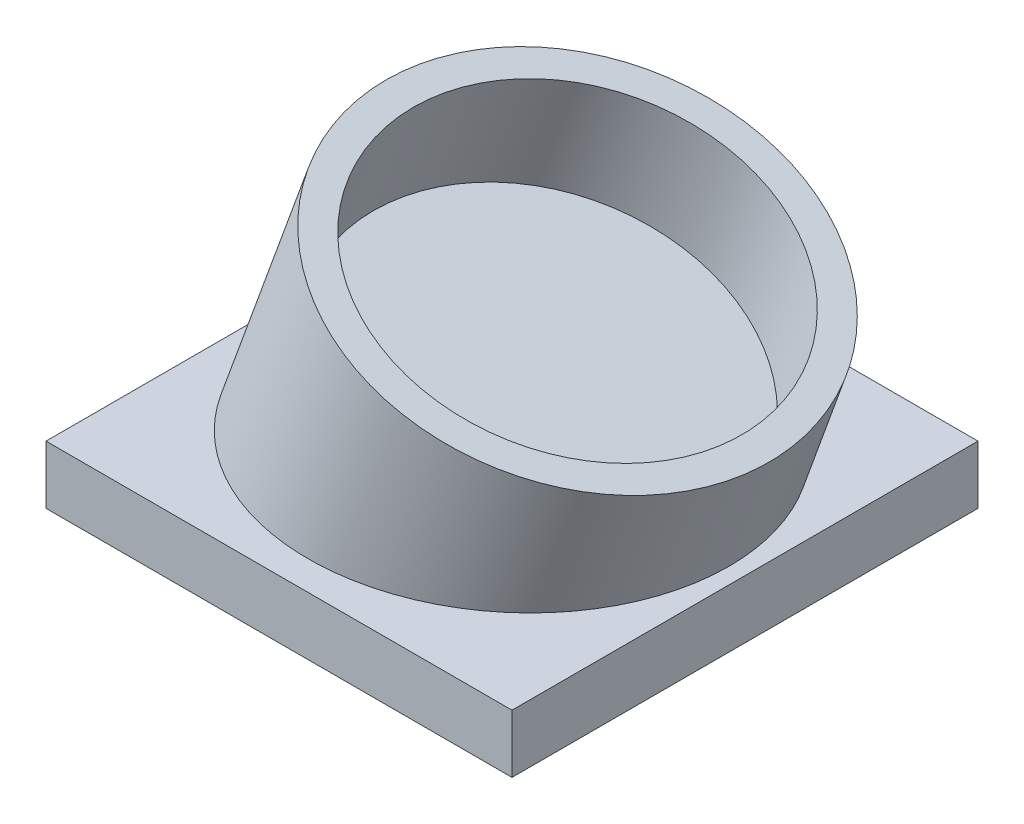
ISO-10303-21;
HEADER;
FILE_DESCRIPTION(('STEP AP214'),'2;1');
FILE_NAME('part.step','',(''),(''),'','','');
FILE_SCHEMA(('AUTOMOTIVE_DESIGN { 1 0 10303 214 1 1 1 1 }'));
ENDSEC;
DATA;
#1=APPLICATION_CONTEXT('core data for automotive mechanical design processes');
#2=APPLICATION_PROTOCOL_DEFINITION('international standard','automotive_design',2000,#1);
#3=PRODUCT_CONTEXT('',#1,'mechanical');
#4=PRODUCT('Part','Part','',(#3));
#5=PRODUCT_RELATED_PRODUCT_CATEGORY('part','',(#4));
#6=PRODUCT_DEFINITION_FORMATION('','',#4);
#7=PRODUCT_DEFINITION_CONTEXT('part definition',#1,'design');
#8=PRODUCT_DEFINITION('design','',#6,#7);
#9=PRODUCT_DEFINITION_SHAPE('','',#8);
#10=(LENGTH_UNIT() NAMED_UNIT(*) SI_UNIT(.MILLI.,.METRE.));
#11=(NAMED_UNIT(*) PLANE_ANGLE_UNIT() SI_UNIT($,.RADIAN.));
#12=(NAMED_UNIT(*) SI_UNIT($,.STERADIAN.) SOLID_ANGLE_UNIT());
#13=UNCERTAINTY_MEASURE_WITH_UNIT(LENGTH_MEASURE(1.E-05),#10,'distance_accuracy_value','');
#14=(GEOMETRIC_REPRESENTATION_CONTEXT(3) GLOBAL_UNCERTAINTY_ASSIGNED_CONTEXT((#13)) GLOBAL_UNIT_ASSIGNED_CONTEXT((#10,
#11,#12)) REPRESENTATION_CONTEXT('',''));
#15=CARTESIAN_POINT('',(0.,0.,0.));
#16=DIRECTION('',(0.,0.,1.));
#17=DIRECTION('',(1.,0.,0.));
#18=AXIS2_PLACEMENT_3D('',#15,#16,#17);
#19=CARTESIAN_POINT('',(0.,12.7,0.));
#20=DIRECTION('',(1.,0.,0.));
#21=DIRECTION('',(0.,0.,-1.));
#22=AXIS2_PLACEMENT_3D('',#19,#20,#21);
#23=PLANE('',#22);
#24=DIRECTION('',(0.,0.,1.));
#25=VECTOR('',#24,1.);
#26=CARTESIAN_POINT('',(0.,0.,0.));
#27=LINE('',#26,#25);
#28=CARTESIAN_POINT('',(0.,0.,-101.6));
#29=VERTEX_POINT('',#28);
#30=CARTESIAN_POINT('',(0.,0.,0.));
#31=VERTEX_POINT('',#30);
#32=EDGE_CURVE('E105',#29,#31,#27,.T.);
#33=ORIENTED_EDGE('',*,*,#32,.T.);
#34=DIRECTION('',(0.,-1.,0.));
#35=VECTOR('',#34,1.);
#36=CARTESIAN_POINT('',(0.,12.7,0.));
#37=LINE('',#36,#35);
#38=CARTESIAN_POINT('',(0.,12.7,0.));
#39=VERTEX_POINT('',#38);
#40=EDGE_CURVE('E47',#39,#31,#37,.T.);
#41=ORIENTED_EDGE('',*,*,#40,.F.);
#42=DIRECTION('',(0.,0.,1.));
#43=VECTOR('',#42,1.);
#44=CARTESIAN_POINT('',(0.,12.7,0.));
#45=LINE('',#44,#43);
#46=CARTESIAN_POINT('',(0.,12.7,-101.6));
#47=VERTEX_POINT('',#46);
#48=EDGE_CURVE('E91',#47,#39,#45,.T.);
#49=ORIENTED_EDGE('',*,*,#48,.F.);
#50=DIRECTION('',(0.,-1.,0.));
#51=VECTOR('',#50,1.);
#52=CARTESIAN_POINT('',(0.,12.7,-101.6));
#53=LINE('',#52,#51);
#54=EDGE_CURVE('E101',#47,#29,#53,.T.);
#55=ORIENTED_EDGE('',*,*,#54,.T.);
#56=EDGE_LOOP('',(#33,#41,#49,#55));
#57=FACE_BOUND('',#56,.T.);
#58=ADVANCED_FACE('F39',(#57),#23,.F.);
#59=CARTESIAN_POINT('',(0.,12.7,0.));
#60=DIRECTION('',(0.,0.,-1.));
#61=DIRECTION('',(-1.,0.,0.));
#62=AXIS2_PLACEMENT_3D('',#59,#60,#61);
#63=PLANE('',#62);
#64=DIRECTION('',(1.,0.,0.));
#65=VECTOR('',#64,1.);
#66=CARTESIAN_POINT('',(0.,0.,0.));
#67=LINE('',#66,#65);
#68=CARTESIAN_POINT('',(101.6,0.,0.));
#69=VERTEX_POINT('',#68);
#70=EDGE_CURVE('E96',#31,#69,#67,.T.);
#71=ORIENTED_EDGE('',*,*,#70,.T.);
#72=DIRECTION('',(0.,-1.,0.));
#73=VECTOR('',#72,1.);
#74=CARTESIAN_POINT('',(101.6,12.7,0.));
#75=LINE('',#74,#73);
#76=CARTESIAN_POINT('',(101.6,12.7,0.));
#77=VERTEX_POINT('',#76);
#78=EDGE_CURVE('E94',#77,#69,#75,.T.);
#79=ORIENTED_EDGE('',*,*,#78,.F.);
#80=DIRECTION('',(1.,0.,0.));
#81=VECTOR('',#80,1.);
#82=CARTESIAN_POINT('',(0.,12.7,0.));
#83=LINE('',#82,#81);
#84=EDGE_CURVE('E86',#39,#77,#83,.T.);
#85=ORIENTED_EDGE('',*,*,#84,.F.);
#86=ORIENTED_EDGE('',*,*,#40,.T.);
#87=EDGE_LOOP('',(#71,#79,#85,#86));
#88=FACE_BOUND('',#87,.T.);
#89=ADVANCED_FACE('F95',(#88),#63,.F.);
#90=CARTESIAN_POINT('',(101.6,12.7,0.));
#91=DIRECTION('',(-1.,0.,0.));
#92=DIRECTION('',(0.,0.,1.));
#93=AXIS2_PLACEMENT_3D('',#90,#91,#92);
#94=PLANE('',#93);
#95=DIRECTION('',(0.,0.,-1.));
#96=VECTOR('',#95,1.);
#97=CARTESIAN_POINT('',(101.6,0.,0.));
#98=LINE('',#97,#96);
#99=CARTESIAN_POINT('',(101.6,0.,-101.6));
#100=VERTEX_POINT('',#99);
#101=EDGE_CURVE('E72',#69,#100,#98,.T.);
#102=ORIENTED_EDGE('',*,*,#101,.T.);
#103=DIRECTION('',(0.,-1.,0.));
#104=VECTOR('',#103,1.);
#105=CARTESIAN_POINT('',(101.6,12.7,-101.6));
#106=LINE('',#105,#104);
#107=CARTESIAN_POINT('',(101.6,12.7,-101.6));
#108=VERTEX_POINT('',#107);
#109=EDGE_CURVE('E97',#108,#100,#106,.T.);
#110=ORIENTED_EDGE('',*,*,#109,.F.);
#111=DIRECTION('',(0.,0.,-1.));
#112=VECTOR('',#111,1.);
#113=CARTESIAN_POINT('',(101.6,12.7,0.));
#114=LINE('',#113,#112);
#115=EDGE_CURVE('E89',#77,#108,#114,.T.);
#116=ORIENTED_EDGE('',*,*,#115,.F.);
#117=ORIENTED_EDGE('',*,*,#78,.T.);
#118=EDGE_LOOP('',(#102,#110,#116,#117));
#119=FACE_BOUND('',#118,.T.);
#120=ADVANCED_FACE('F99',(#119),#94,.F.);
#121=CARTESIAN_POINT('',(0.,12.7,-101.6));
#122=DIRECTION('',(0.,0.,1.));
#123=DIRECTION('',(1.,0.,0.));
#124=AXIS2_PLACEMENT_3D('',#121,#122,#123);
#125=PLANE('',#124);
#126=DIRECTION('',(-1.,0.,0.));
#127=VECTOR('',#126,1.);
#128=CARTESIAN_POINT('',(0.,0.,-101.6));
#129=LINE('',#128,#127);
#130=EDGE_CURVE('E78',#100,#29,#129,.T.);
#131=ORIENTED_EDGE('',*,*,#130,.T.);
#132=ORIENTED_EDGE('',*,*,#54,.F.);
#133=DIRECTION('',(-1.,0.,0.));
#134=VECTOR('',#133,1.);
#135=CARTESIAN_POINT('',(0.,12.7,-101.6));
#136=LINE('',#135,#134);
#137=EDGE_CURVE('E55',#108,#47,#136,.T.);
#138=ORIENTED_EDGE('',*,*,#137,.F.);
#139=ORIENTED_EDGE('',*,*,#109,.T.);
#140=EDGE_LOOP('',(#131,#132,#138,#139));
#141=FACE_BOUND('',#140,.T.);
#142=ADVANCED_FACE('F127',(#141),#125,.F.);
#143=CARTESIAN_POINT('',(0.,12.7,0.));
#144=DIRECTION('',(0.,-1.,0.));
#145=DIRECTION('',(0.,0.,-1.));
#146=AXIS2_PLACEMENT_3D('',#143,#144,#145);
#147=PLANE('',#146);
#148=CARTESIAN_POINT('',(50.8,12.7,-50.8));
#149=DIRECTION('',(0.,-1.,0.));
#150=DIRECTION('',(1.,0.,0.));
#151=AXIS2_PLACEMENT_3D('',#148,#149,#150);
#152=ELLIPSE('',#151,47.3027019865543,44.45);
#153=CARTESIAN_POINT('',(98.1027019865543,12.7,-50.8));
#154=VERTEX_POINT('',#153);
#155=EDGE_CURVE('E108',#154,#154,#152,.T.);
#156=ORIENTED_EDGE('',*,*,#155,.T.);
#157=EDGE_LOOP('',(#156));
#158=FACE_BOUND('',#157,.T.);
#159=ORIENTED_EDGE('',*,*,#48,.T.);
#160=ORIENTED_EDGE('',*,*,#84,.T.);
#161=ORIENTED_EDGE('',*,*,#115,.T.);
#162=ORIENTED_EDGE('',*,*,#137,.T.);
#163=EDGE_LOOP('',(#159,#160,#161,#162));
#164=FACE_BOUND('',#163,.T.);
#165=ADVANCED_FACE('F87',(#158,#164),#147,.F.);
#166=CARTESIAN_POINT('',(0.,0.,0.));
#167=DIRECTION('',(0.,-1.,0.));
#168=DIRECTION('',(0.,0.,-1.));
#169=AXIS2_PLACEMENT_3D('',#166,#167,#168);
#170=PLANE('',#169);
#171=ORIENTED_EDGE('',*,*,#32,.F.);
#172=ORIENTED_EDGE('',*,*,#130,.F.);
#173=ORIENTED_EDGE('',*,*,#101,.F.);
#174=ORIENTED_EDGE('',*,*,#70,.F.);
#175=EDGE_LOOP('',(#171,#172,#173,#174));
#176=FACE_BOUND('',#175,.T.);
#177=ADVANCED_FACE('F116',(#176),#170,.T.);
#178=CARTESIAN_POINT('',(6.42017913150263,-109.232555715637,-50.8));
#179=DIRECTION('',(0.342020143325669,0.939692620785908,0.));
#180=DIRECTION('',(-0.939692620785908,0.342020143325669,0.));
#181=AXIS2_PLACEMENT_3D('',#178,#179,#180);
#182=CYLINDRICAL_SURFACE('',#181,44.45);
#183=ORIENTED_EDGE('',*,*,#155,.F.);
#184=EDGE_LOOP('',(#183));
#185=FACE_BOUND('',#184,.T.);
#186=CARTESIAN_POINT('',(65.0877626419243,51.9553052332143,-50.8));
#187=DIRECTION('',(0.342020143325669,0.939692620785908,0.));
#188=DIRECTION('',(-0.939692620785908,0.342020143325669,0.));
#189=AXIS2_PLACEMENT_3D('',#186,#187,#188);
#190=CIRCLE('',#189,44.45);
#191=CARTESIAN_POINT('',(23.3184256479907,67.1581006040403,-50.8));
#192=VERTEX_POINT('',#191);
#193=EDGE_CURVE('E240',#192,#192,#190,.T.);
#194=ORIENTED_EDGE('',*,*,#193,.F.);
#195=EDGE_LOOP('',(#194));
#196=FACE_BOUND('',#195,.T.);
#197=ADVANCED_FACE('F118',(#185,#196),#182,.T.);
#198=CARTESIAN_POINT('',(65.0877626419243,51.9553052332143,-50.8));
#199=DIRECTION('',(0.342020143325669,0.939692620785908,0.));
#200=DIRECTION('',(-0.939692620785908,0.342020143325669,0.));
#201=AXIS2_PLACEMENT_3D('',#198,#199,#200);
#202=PLANE('',#201);
#203=ORIENTED_EDGE('',*,*,#193,.T.);
#204=EDGE_LOOP('',(#203));
#205=FACE_BOUND('',#204,.T.);
#206=CARTESIAN_POINT('',(65.0877626419243,51.9553052332143,-50.8));
#207=DIRECTION('',(0.342020143325669,0.939692620785908,0.));
#208=DIRECTION('',(-0.939692620785908,0.342020143325669,0.));
#209=AXIS2_PLACEMENT_3D('',#206,#207,#208);
#210=CIRCLE('',#209,38.1);
#211=CARTESIAN_POINT('',(29.2854737899812,64.9862726939223,-50.8));
#212=VERTEX_POINT('',#211);
#213=EDGE_CURVE('E238',#212,#212,#210,.T.);
#214=ORIENTED_EDGE('',*,*,#213,.F.);
#215=EDGE_LOOP('',(#214));
#216=FACE_BOUND('',#215,.T.);
#217=ADVANCED_FACE('F124',(#205,#216),#202,.T.);
#218=CARTESIAN_POINT('',(56.4004510014523,28.0871126652522,-50.8));
#219=DIRECTION('',(-0.342020143325669,-0.939692620785908,0.));
#220=DIRECTION('',(0.939692620785908,-0.342020143325669,0.));
#221=AXIS2_PLACEMENT_3D('',#218,#219,#220);
#222=PLANE('',#221);
#223=CARTESIAN_POINT('',(56.4004510014523,28.0871126652522,-50.8));
#224=DIRECTION('',(-0.342020143325669,-0.939692620785908,0.));
#225=DIRECTION('',(0.939692620785908,-0.342020143325669,0.));
#226=AXIS2_PLACEMENT_3D('',#223,#224,#225);
#227=CIRCLE('',#226,38.1);
#228=CARTESIAN_POINT('',(92.2027398533954,15.0561452045442,-50.8));
#229=VERTEX_POINT('',#228);
#230=EDGE_CURVE('E11',#229,#229,#227,.T.);
#231=ORIENTED_EDGE('',*,*,#230,.F.);
#232=EDGE_LOOP('',(#231));
#233=FACE_BOUND('',#232,.T.);
#234=ADVANCED_FACE('F156',(#233),#222,.F.);
#235=CARTESIAN_POINT('',(56.4004510014523,28.0871126652522,-50.8));
#236=DIRECTION('',(0.342020143325669,0.939692620785908,0.));
#237=DIRECTION('',(-0.939692620785908,0.342020143325669,0.));
#238=AXIS2_PLACEMENT_3D('',#235,#236,#237);
#239=CYLINDRICAL_SURFACE('',#238,38.1);
#240=ORIENTED_EDGE('',*,*,#230,.T.);
#241=EDGE_LOOP('',(#240));
#242=FACE_BOUND('',#241,.T.);
#243=ORIENTED_EDGE('',*,*,#213,.T.);
#244=EDGE_LOOP('',(#243));
#245=FACE_BOUND('',#244,.T.);
#246=ADVANCED_FACE('F161',(#242,#245),#239,.F.);
#247=CLOSED_SHELL('',(#58,#89,#120,#142,#165,#177,#197,#217,#234,#246));
#248=MANIFOLD_SOLID_BREP('B2',#247);
#249=ADVANCED_BREP_SHAPE_REPRESENTATION('',(#18,#248),#14);
#250=SHAPE_DEFINITION_REPRESENTATION(#9,#249);
ENDSEC;
END-ISO-10303-21;
